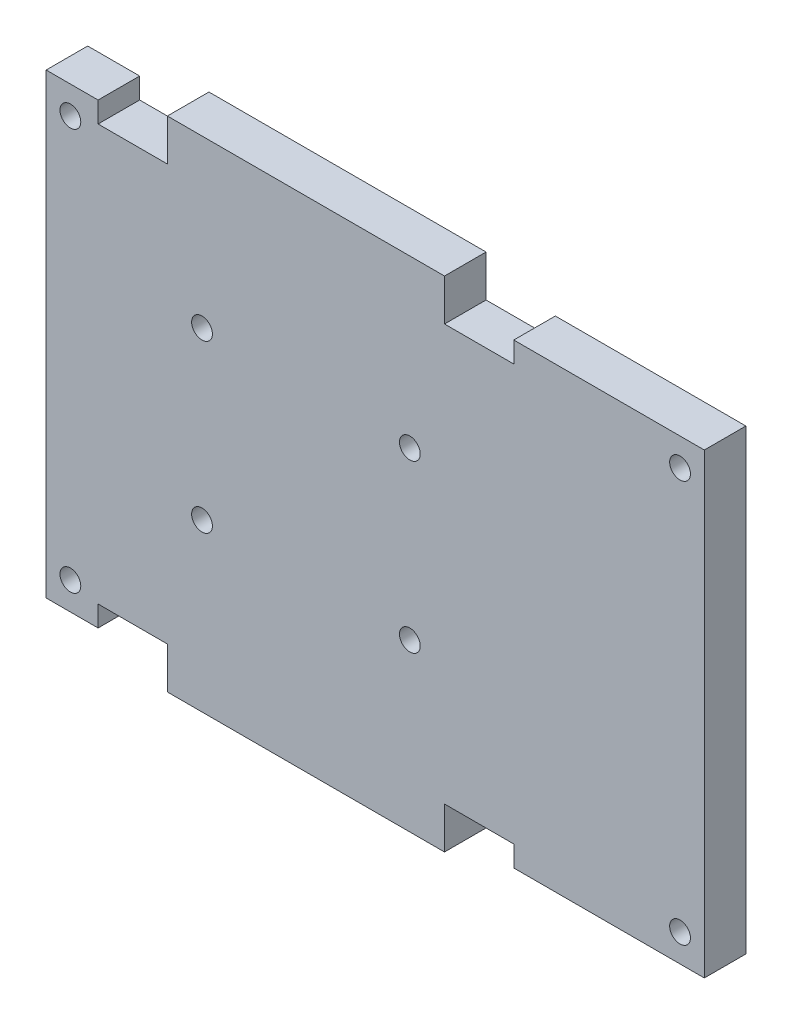
ISO-10303-21;
HEADER;
FILE_DESCRIPTION(('STEP AP214'),'2;1');
FILE_NAME('part.step','',(''),(''),'','','');
FILE_SCHEMA(('AUTOMOTIVE_DESIGN { 1 0 10303 214 1 1 1 1 }'));
ENDSEC;
DATA;
#1=APPLICATION_CONTEXT('core data for automotive mechanical design processes');
#2=APPLICATION_PROTOCOL_DEFINITION('international standard','automotive_design',2000,#1);
#3=PRODUCT_CONTEXT('',#1,'mechanical');
#4=PRODUCT('Part','Part','',(#3));
#5=PRODUCT_RELATED_PRODUCT_CATEGORY('part','',(#4));
#6=PRODUCT_DEFINITION_FORMATION('','',#4);
#7=PRODUCT_DEFINITION_CONTEXT('part definition',#1,'design');
#8=PRODUCT_DEFINITION('design','',#6,#7);
#9=PRODUCT_DEFINITION_SHAPE('','',#8);
#10=(LENGTH_UNIT() NAMED_UNIT(*) SI_UNIT(.MILLI.,.METRE.));
#11=(NAMED_UNIT(*) PLANE_ANGLE_UNIT() SI_UNIT($,.RADIAN.));
#12=(NAMED_UNIT(*) SI_UNIT($,.STERADIAN.) SOLID_ANGLE_UNIT());
#13=UNCERTAINTY_MEASURE_WITH_UNIT(LENGTH_MEASURE(1.E-05),#10,'distance_accuracy_value','');
#14=(GEOMETRIC_REPRESENTATION_CONTEXT(3) GLOBAL_UNCERTAINTY_ASSIGNED_CONTEXT((#13)) GLOBAL_UNIT_ASSIGNED_CONTEXT((#10,
#11,#12)) REPRESENTATION_CONTEXT('',''));
#15=CARTESIAN_POINT('',(0.,0.,0.));
#16=DIRECTION('',(0.,0.,1.));
#17=DIRECTION('',(1.,0.,0.));
#18=AXIS2_PLACEMENT_3D('',#15,#16,#17);
#19=CARTESIAN_POINT('',(-30.,36.,6.));
#20=DIRECTION('',(0.,-1.,0.));
#21=DIRECTION('',(0.,0.,-1.));
#22=AXIS2_PLACEMENT_3D('',#19,#20,#21);
#23=PLANE('',#22);
#24=DIRECTION('',(-1.,0.,0.));
#25=VECTOR('',#24,1.);
#26=CARTESIAN_POINT('',(-30.,36.,6.));
#27=LINE('',#26,#25);
#28=CARTESIAN_POINT('',(20.,36.,6.));
#29=VERTEX_POINT('',#28);
#30=CARTESIAN_POINT('',(-20.,36.,6.));
#31=VERTEX_POINT('',#30);
#32=EDGE_CURVE('E43',#29,#31,#27,.T.);
#33=ORIENTED_EDGE('',*,*,#32,.F.);
#34=DIRECTION('',(0.,0.,1.));
#35=VECTOR('',#34,1.);
#36=CARTESIAN_POINT('',(20.,36.,0.));
#37=LINE('',#36,#35);
#38=CARTESIAN_POINT('',(20.,36.,0.));
#39=VERTEX_POINT('',#38);
#40=EDGE_CURVE('E293',#39,#29,#37,.T.);
#41=ORIENTED_EDGE('',*,*,#40,.F.);
#42=DIRECTION('',(-1.,0.,0.));
#43=VECTOR('',#42,1.);
#44=CARTESIAN_POINT('',(-30.,36.,0.));
#45=LINE('',#44,#43);
#46=CARTESIAN_POINT('',(-20.,36.,0.));
#47=VERTEX_POINT('',#46);
#48=EDGE_CURVE('E336',#39,#47,#45,.T.);
#49=ORIENTED_EDGE('',*,*,#48,.T.);
#50=DIRECTION('',(0.,0.,1.));
#51=VECTOR('',#50,1.);
#52=CARTESIAN_POINT('',(-20.,36.,0.));
#53=LINE('',#52,#51);
#54=EDGE_CURVE('E304',#47,#31,#53,.T.);
#55=ORIENTED_EDGE('',*,*,#54,.T.);
#56=EDGE_LOOP('',(#33,#41,#49,#55));
#57=FACE_BOUND('',#56,.T.);
#58=ADVANCED_FACE('F35',(#57),#23,.F.);
#59=CARTESIAN_POINT('',(-30.,-36.,6.));
#60=DIRECTION('',(0.,1.,0.));
#61=DIRECTION('',(0.,0.,1.));
#62=AXIS2_PLACEMENT_3D('',#59,#60,#61);
#63=PLANE('',#62);
#64=DIRECTION('',(1.,0.,0.));
#65=VECTOR('',#64,1.);
#66=CARTESIAN_POINT('',(-30.,-36.,0.));
#67=LINE('',#66,#65);
#68=CARTESIAN_POINT('',(-20.,-36.,0.));
#69=VERTEX_POINT('',#68);
#70=CARTESIAN_POINT('',(20.,-36.,0.));
#71=VERTEX_POINT('',#70);
#72=EDGE_CURVE('E38',#69,#71,#67,.T.);
#73=ORIENTED_EDGE('',*,*,#72,.T.);
#74=DIRECTION('',(0.,0.,1.));
#75=VECTOR('',#74,1.);
#76=CARTESIAN_POINT('',(20.,-36.,0.));
#77=LINE('',#76,#75);
#78=CARTESIAN_POINT('',(20.,-36.,6.));
#79=VERTEX_POINT('',#78);
#80=EDGE_CURVE('E268',#71,#79,#77,.T.);
#81=ORIENTED_EDGE('',*,*,#80,.T.);
#82=DIRECTION('',(1.,0.,0.));
#83=VECTOR('',#82,1.);
#84=CARTESIAN_POINT('',(-30.,-36.,6.));
#85=LINE('',#84,#83);
#86=CARTESIAN_POINT('',(-20.,-36.,6.));
#87=VERTEX_POINT('',#86);
#88=EDGE_CURVE('E11',#87,#79,#85,.T.);
#89=ORIENTED_EDGE('',*,*,#88,.F.);
#90=DIRECTION('',(0.,0.,1.));
#91=VECTOR('',#90,1.);
#92=CARTESIAN_POINT('',(-20.,-36.,0.));
#93=LINE('',#92,#91);
#94=EDGE_CURVE('E270',#69,#87,#93,.T.);
#95=ORIENTED_EDGE('',*,*,#94,.F.);
#96=EDGE_LOOP('',(#73,#81,#89,#95));
#97=FACE_BOUND('',#96,.T.);
#98=ADVANCED_FACE('F346',(#97),#63,.F.);
#99=CARTESIAN_POINT('',(0.,0.,6.));
#100=DIRECTION('',(0.,0.,-1.));
#101=DIRECTION('',(-1.,0.,0.));
#102=AXIS2_PLACEMENT_3D('',#99,#100,#101);
#103=PLANE('',#102);
#104=CARTESIAN_POINT('',(-34.,-29.,6.));
#105=DIRECTION('',(0.,0.,1.));
#106=DIRECTION('',(1.,0.,0.));
#107=AXIS2_PLACEMENT_3D('',#104,#105,#106);
#108=CIRCLE('',#107,1.5);
#109=CARTESIAN_POINT('',(-32.5,-29.,6.));
#110=VERTEX_POINT('',#109);
#111=EDGE_CURVE('E396',#110,#110,#108,.T.);
#112=ORIENTED_EDGE('',*,*,#111,.F.);
#113=EDGE_LOOP('',(#112));
#114=FACE_BOUND('',#113,.T.);
#115=CARTESIAN_POINT('',(-34.,29.,6.));
#116=DIRECTION('',(0.,0.,1.));
#117=DIRECTION('',(1.,0.,0.));
#118=AXIS2_PLACEMENT_3D('',#115,#116,#117);
#119=CIRCLE('',#118,1.5);
#120=CARTESIAN_POINT('',(-32.5,29.,6.));
#121=VERTEX_POINT('',#120);
#122=EDGE_CURVE('E402',#121,#121,#119,.T.);
#123=ORIENTED_EDGE('',*,*,#122,.F.);
#124=EDGE_LOOP('',(#123));
#125=FACE_BOUND('',#124,.T.);
#126=CARTESIAN_POINT('',(54.,29.,6.));
#127=DIRECTION('',(0.,0.,1.));
#128=DIRECTION('',(1.,0.,0.));
#129=AXIS2_PLACEMENT_3D('',#126,#127,#128);
#130=CIRCLE('',#129,1.5);
#131=CARTESIAN_POINT('',(55.5,29.,6.));
#132=VERTEX_POINT('',#131);
#133=EDGE_CURVE('E408',#132,#132,#130,.T.);
#134=ORIENTED_EDGE('',*,*,#133,.F.);
#135=EDGE_LOOP('',(#134));
#136=FACE_BOUND('',#135,.T.);
#137=CARTESIAN_POINT('',(54.,-29.,6.));
#138=DIRECTION('',(0.,0.,1.));
#139=DIRECTION('',(1.,0.,0.));
#140=AXIS2_PLACEMENT_3D('',#137,#138,#139);
#141=CIRCLE('',#140,1.5);
#142=CARTESIAN_POINT('',(55.5,-29.,6.));
#143=VERTEX_POINT('',#142);
#144=EDGE_CURVE('E390',#143,#143,#141,.T.);
#145=ORIENTED_EDGE('',*,*,#144,.F.);
#146=EDGE_LOOP('',(#145));
#147=FACE_BOUND('',#146,.T.);
#148=CARTESIAN_POINT('',(15.,12.,6.));
#149=DIRECTION('',(0.,0.,1.));
#150=DIRECTION('',(1.,0.,0.));
#151=AXIS2_PLACEMENT_3D('',#148,#149,#150);
#152=CIRCLE('',#151,1.5);
#153=CARTESIAN_POINT('',(16.5,12.,6.));
#154=VERTEX_POINT('',#153);
#155=EDGE_CURVE('E239',#154,#154,#152,.T.);
#156=ORIENTED_EDGE('',*,*,#155,.F.);
#157=EDGE_LOOP('',(#156));
#158=FACE_BOUND('',#157,.T.);
#159=CARTESIAN_POINT('',(15.,-12.,6.));
#160=DIRECTION('',(0.,0.,1.));
#161=DIRECTION('',(1.,0.,0.));
#162=AXIS2_PLACEMENT_3D('',#159,#160,#161);
#163=CIRCLE('',#162,1.5);
#164=CARTESIAN_POINT('',(16.5,-12.,6.));
#165=VERTEX_POINT('',#164);
#166=EDGE_CURVE('E250',#165,#165,#163,.T.);
#167=ORIENTED_EDGE('',*,*,#166,.F.);
#168=EDGE_LOOP('',(#167));
#169=FACE_BOUND('',#168,.T.);
#170=CARTESIAN_POINT('',(-15.,-12.,6.));
#171=DIRECTION('',(0.,0.,1.));
#172=DIRECTION('',(1.,0.,0.));
#173=AXIS2_PLACEMENT_3D('',#170,#171,#172);
#174=CIRCLE('',#173,1.5);
#175=CARTESIAN_POINT('',(-13.5,-12.,6.));
#176=VERTEX_POINT('',#175);
#177=EDGE_CURVE('E244',#176,#176,#174,.T.);
#178=ORIENTED_EDGE('',*,*,#177,.F.);
#179=EDGE_LOOP('',(#178));
#180=FACE_BOUND('',#179,.T.);
#181=CARTESIAN_POINT('',(-15.,12.,6.));
#182=DIRECTION('',(0.,0.,1.));
#183=DIRECTION('',(1.,0.,0.));
#184=AXIS2_PLACEMENT_3D('',#181,#182,#183);
#185=CIRCLE('',#184,1.5);
#186=CARTESIAN_POINT('',(-13.5,12.,6.));
#187=VERTEX_POINT('',#186);
#188=EDGE_CURVE('E243',#187,#187,#185,.T.);
#189=ORIENTED_EDGE('',*,*,#188,.F.);
#190=EDGE_LOOP('',(#189));
#191=FACE_BOUND('',#190,.T.);
#192=DIRECTION('',(1.,0.,0.));
#193=VECTOR('',#192,1.);
#194=CARTESIAN_POINT('',(0.,-30.,6.));
#195=LINE('',#194,#193);
#196=CARTESIAN_POINT('',(20.,-30.,6.));
#197=VERTEX_POINT('',#196);
#198=CARTESIAN_POINT('',(30.,-30.,6.));
#199=VERTEX_POINT('',#198);
#200=EDGE_CURVE('E324',#197,#199,#195,.T.);
#201=ORIENTED_EDGE('',*,*,#200,.T.);
#202=DIRECTION('',(0.,-1.,0.));
#203=VECTOR('',#202,1.);
#204=CARTESIAN_POINT('',(30.,33.,6.));
#205=LINE('',#204,#203);
#206=CARTESIAN_POINT('',(30.,-33.,5.99999999999999));
#207=VERTEX_POINT('',#206);
#208=EDGE_CURVE('E201',#199,#207,#205,.T.);
#209=ORIENTED_EDGE('',*,*,#208,.T.);
#210=DIRECTION('',(-1.,0.,0.));
#211=VECTOR('',#210,1.);
#212=CARTESIAN_POINT('',(57.5,-33.,5.99999999999999));
#213=LINE('',#212,#211);
#214=CARTESIAN_POINT('',(57.5,-33.,5.99999999999999));
#215=VERTEX_POINT('',#214);
#216=EDGE_CURVE('E236',#215,#207,#213,.T.);
#217=ORIENTED_EDGE('',*,*,#216,.F.);
#218=DIRECTION('',(0.,-1.,0.));
#219=VECTOR('',#218,1.);
#220=CARTESIAN_POINT('',(57.5,33.,6.));
#221=LINE('',#220,#219);
#222=CARTESIAN_POINT('',(57.5,33.,6.));
#223=VERTEX_POINT('',#222);
#224=EDGE_CURVE('E209',#223,#215,#221,.T.);
#225=ORIENTED_EDGE('',*,*,#224,.F.);
#226=DIRECTION('',(-1.,0.,0.));
#227=VECTOR('',#226,1.);
#228=CARTESIAN_POINT('',(57.5,33.,6.));
#229=LINE('',#228,#227);
#230=CARTESIAN_POINT('',(30.,33.,6.));
#231=VERTEX_POINT('',#230);
#232=EDGE_CURVE('E218',#223,#231,#229,.T.);
#233=ORIENTED_EDGE('',*,*,#232,.T.);
#234=CARTESIAN_POINT('',(30.,30.,6.));
#235=VERTEX_POINT('',#234);
#236=EDGE_CURVE('E203',#231,#235,#205,.T.);
#237=ORIENTED_EDGE('',*,*,#236,.T.);
#238=DIRECTION('',(-1.,0.,0.));
#239=VECTOR('',#238,1.);
#240=CARTESIAN_POINT('',(0.,30.,6.));
#241=LINE('',#240,#239);
#242=CARTESIAN_POINT('',(20.,30.,6.));
#243=VERTEX_POINT('',#242);
#244=EDGE_CURVE('E333',#235,#243,#241,.T.);
#245=ORIENTED_EDGE('',*,*,#244,.T.);
#246=DIRECTION('',(0.,1.,0.));
#247=VECTOR('',#246,1.);
#248=CARTESIAN_POINT('',(20.,0.,6.));
#249=LINE('',#248,#247);
#250=EDGE_CURVE('E330',#243,#29,#249,.T.);
#251=ORIENTED_EDGE('',*,*,#250,.T.);
#252=ORIENTED_EDGE('',*,*,#32,.T.);
#253=DIRECTION('',(0.,-1.,0.));
#254=VECTOR('',#253,1.);
#255=CARTESIAN_POINT('',(-20.,0.,6.));
#256=LINE('',#255,#254);
#257=CARTESIAN_POINT('',(-20.,30.,6.));
#258=VERTEX_POINT('',#257);
#259=EDGE_CURVE('E315',#31,#258,#256,.T.);
#260=ORIENTED_EDGE('',*,*,#259,.T.);
#261=DIRECTION('',(-1.,0.,0.));
#262=VECTOR('',#261,1.);
#263=CARTESIAN_POINT('',(0.,30.,6.));
#264=LINE('',#263,#262);
#265=CARTESIAN_POINT('',(-30.,30.,6.));
#266=VERTEX_POINT('',#265);
#267=EDGE_CURVE('E307',#258,#266,#264,.T.);
#268=ORIENTED_EDGE('',*,*,#267,.T.);
#269=DIRECTION('',(0.,1.,0.));
#270=VECTOR('',#269,1.);
#271=CARTESIAN_POINT('',(-30.,33.,6.));
#272=LINE('',#271,#270);
#273=CARTESIAN_POINT('',(-30.,33.,6.));
#274=VERTEX_POINT('',#273);
#275=EDGE_CURVE('E367',#266,#274,#272,.T.);
#276=ORIENTED_EDGE('',*,*,#275,.T.);
#277=DIRECTION('',(1.,0.,0.));
#278=VECTOR('',#277,1.);
#279=CARTESIAN_POINT('',(-37.5,33.,6.));
#280=LINE('',#279,#278);
#281=CARTESIAN_POINT('',(-37.5,33.,6.));
#282=VERTEX_POINT('',#281);
#283=EDGE_CURVE('E205',#282,#274,#280,.T.);
#284=ORIENTED_EDGE('',*,*,#283,.F.);
#285=DIRECTION('',(0.,1.,0.));
#286=VECTOR('',#285,1.);
#287=CARTESIAN_POINT('',(-37.5,33.,6.));
#288=LINE('',#287,#286);
#289=CARTESIAN_POINT('',(-37.5,-33.,6.));
#290=VERTEX_POINT('',#289);
#291=EDGE_CURVE('E185',#290,#282,#288,.T.);
#292=ORIENTED_EDGE('',*,*,#291,.F.);
#293=DIRECTION('',(1.,0.,0.));
#294=VECTOR('',#293,1.);
#295=CARTESIAN_POINT('',(-37.5,-33.,6.));
#296=LINE('',#295,#294);
#297=CARTESIAN_POINT('',(-30.,-33.,6.));
#298=VERTEX_POINT('',#297);
#299=EDGE_CURVE('E182',#290,#298,#296,.T.);
#300=ORIENTED_EDGE('',*,*,#299,.T.);
#301=CARTESIAN_POINT('',(-30.,-30.,6.));
#302=VERTEX_POINT('',#301);
#303=EDGE_CURVE('E366',#298,#302,#272,.T.);
#304=ORIENTED_EDGE('',*,*,#303,.T.);
#305=DIRECTION('',(1.,0.,0.));
#306=VECTOR('',#305,1.);
#307=CARTESIAN_POINT('',(0.,-30.,6.));
#308=LINE('',#307,#306);
#309=CARTESIAN_POINT('',(-20.,-30.,6.));
#310=VERTEX_POINT('',#309);
#311=EDGE_CURVE('E321',#302,#310,#308,.T.);
#312=ORIENTED_EDGE('',*,*,#311,.T.);
#313=DIRECTION('',(0.,-1.,0.));
#314=VECTOR('',#313,1.);
#315=CARTESIAN_POINT('',(-20.,0.,6.));
#316=LINE('',#315,#314);
#317=EDGE_CURVE('E318',#310,#87,#316,.T.);
#318=ORIENTED_EDGE('',*,*,#317,.T.);
#319=ORIENTED_EDGE('',*,*,#88,.T.);
#320=DIRECTION('',(0.,1.,0.));
#321=VECTOR('',#320,1.);
#322=CARTESIAN_POINT('',(20.,0.,6.));
#323=LINE('',#322,#321);
#324=EDGE_CURVE('E327',#79,#197,#323,.T.);
#325=ORIENTED_EDGE('',*,*,#324,.T.);
#326=EDGE_LOOP('',(#201,#209,#217,#225,#233,#237,#245,#251,#252,#260,#268,#276,#284,#292,#300,
#304,#312,#318,#319,#325));
#327=FACE_BOUND('',#326,.T.);
#328=ADVANCED_FACE('F354',(#114,#125,#136,#147,#158,#169,#180,#191,#327),#103,.F.);
#329=CARTESIAN_POINT('',(0.,0.,0.));
#330=DIRECTION('',(0.,0.,-1.));
#331=DIRECTION('',(-1.,0.,0.));
#332=AXIS2_PLACEMENT_3D('',#329,#330,#331);
#333=PLANE('',#332);
#334=CARTESIAN_POINT('',(-34.,-29.,0.));
#335=DIRECTION('',(0.,0.,1.));
#336=DIRECTION('',(1.,0.,0.));
#337=AXIS2_PLACEMENT_3D('',#334,#335,#336);
#338=CIRCLE('',#337,1.5);
#339=CARTESIAN_POINT('',(-32.5,-29.,0.));
#340=VERTEX_POINT('',#339);
#341=EDGE_CURVE('E399',#340,#340,#338,.T.);
#342=ORIENTED_EDGE('',*,*,#341,.T.);
#343=EDGE_LOOP('',(#342));
#344=FACE_BOUND('',#343,.T.);
#345=CARTESIAN_POINT('',(-34.,29.,0.));
#346=DIRECTION('',(0.,0.,1.));
#347=DIRECTION('',(1.,0.,0.));
#348=AXIS2_PLACEMENT_3D('',#345,#346,#347);
#349=CIRCLE('',#348,1.5);
#350=CARTESIAN_POINT('',(-32.5,29.,0.));
#351=VERTEX_POINT('',#350);
#352=EDGE_CURVE('E405',#351,#351,#349,.T.);
#353=ORIENTED_EDGE('',*,*,#352,.T.);
#354=EDGE_LOOP('',(#353));
#355=FACE_BOUND('',#354,.T.);
#356=CARTESIAN_POINT('',(54.,29.,0.));
#357=DIRECTION('',(0.,0.,1.));
#358=DIRECTION('',(1.,0.,0.));
#359=AXIS2_PLACEMENT_3D('',#356,#357,#358);
#360=CIRCLE('',#359,1.5);
#361=CARTESIAN_POINT('',(55.5,29.,0.));
#362=VERTEX_POINT('',#361);
#363=EDGE_CURVE('E393',#362,#362,#360,.T.);
#364=ORIENTED_EDGE('',*,*,#363,.T.);
#365=EDGE_LOOP('',(#364));
#366=FACE_BOUND('',#365,.T.);
#367=CARTESIAN_POINT('',(54.,-29.,0.));
#368=DIRECTION('',(0.,0.,1.));
#369=DIRECTION('',(1.,0.,0.));
#370=AXIS2_PLACEMENT_3D('',#367,#368,#369);
#371=CIRCLE('',#370,1.5);
#372=CARTESIAN_POINT('',(55.5,-29.,0.));
#373=VERTEX_POINT('',#372);
#374=EDGE_CURVE('E386',#373,#373,#371,.T.);
#375=ORIENTED_EDGE('',*,*,#374,.T.);
#376=EDGE_LOOP('',(#375));
#377=FACE_BOUND('',#376,.T.);
#378=CARTESIAN_POINT('',(15.,12.,0.));
#379=DIRECTION('',(0.,0.,1.));
#380=DIRECTION('',(1.,0.,0.));
#381=AXIS2_PLACEMENT_3D('',#378,#379,#380);
#382=CIRCLE('',#381,1.5);
#383=CARTESIAN_POINT('',(16.5,12.,0.));
#384=VERTEX_POINT('',#383);
#385=EDGE_CURVE('E253',#384,#384,#382,.T.);
#386=ORIENTED_EDGE('',*,*,#385,.T.);
#387=EDGE_LOOP('',(#386));
#388=FACE_BOUND('',#387,.T.);
#389=CARTESIAN_POINT('',(15.,-12.,0.));
#390=DIRECTION('',(0.,0.,1.));
#391=DIRECTION('',(1.,0.,0.));
#392=AXIS2_PLACEMENT_3D('',#389,#390,#391);
#393=CIRCLE('',#392,1.5);
#394=CARTESIAN_POINT('',(16.5,-12.,0.));
#395=VERTEX_POINT('',#394);
#396=EDGE_CURVE('E247',#395,#395,#393,.T.);
#397=ORIENTED_EDGE('',*,*,#396,.T.);
#398=EDGE_LOOP('',(#397));
#399=FACE_BOUND('',#398,.T.);
#400=CARTESIAN_POINT('',(-15.,-12.,0.));
#401=DIRECTION('',(0.,0.,1.));
#402=DIRECTION('',(1.,0.,0.));
#403=AXIS2_PLACEMENT_3D('',#400,#401,#402);
#404=CIRCLE('',#403,1.5);
#405=CARTESIAN_POINT('',(-13.5,-12.,0.));
#406=VERTEX_POINT('',#405);
#407=EDGE_CURVE('E240',#406,#406,#404,.T.);
#408=ORIENTED_EDGE('',*,*,#407,.T.);
#409=EDGE_LOOP('',(#408));
#410=FACE_BOUND('',#409,.T.);
#411=CARTESIAN_POINT('',(-15.,12.,0.));
#412=DIRECTION('',(0.,0.,1.));
#413=DIRECTION('',(1.,0.,0.));
#414=AXIS2_PLACEMENT_3D('',#411,#412,#413);
#415=CIRCLE('',#414,1.5);
#416=CARTESIAN_POINT('',(-13.5,12.,0.));
#417=VERTEX_POINT('',#416);
#418=EDGE_CURVE('E258',#417,#417,#415,.T.);
#419=ORIENTED_EDGE('',*,*,#418,.T.);
#420=EDGE_LOOP('',(#419));
#421=FACE_BOUND('',#420,.T.);
#422=DIRECTION('',(1.,0.,0.));
#423=VECTOR('',#422,1.);
#424=CARTESIAN_POINT('',(30.,30.,0.));
#425=LINE('',#424,#423);
#426=CARTESIAN_POINT('',(20.,30.,0.));
#427=VERTEX_POINT('',#426);
#428=CARTESIAN_POINT('',(30.,30.,0.));
#429=VERTEX_POINT('',#428);
#430=EDGE_CURVE('E51',#427,#429,#425,.T.);
#431=ORIENTED_EDGE('',*,*,#430,.T.);
#432=DIRECTION('',(0.,1.,0.));
#433=VECTOR('',#432,1.);
#434=CARTESIAN_POINT('',(30.,33.,0.));
#435=LINE('',#434,#433);
#436=CARTESIAN_POINT('',(30.,33.,0.));
#437=VERTEX_POINT('',#436);
#438=EDGE_CURVE('E223',#429,#437,#435,.T.);
#439=ORIENTED_EDGE('',*,*,#438,.T.);
#440=DIRECTION('',(-1.,0.,0.));
#441=VECTOR('',#440,1.);
#442=CARTESIAN_POINT('',(57.5,33.,0.));
#443=LINE('',#442,#441);
#444=CARTESIAN_POINT('',(57.5,33.,0.));
#445=VERTEX_POINT('',#444);
#446=EDGE_CURVE('E230',#445,#437,#443,.T.);
#447=ORIENTED_EDGE('',*,*,#446,.F.);
#448=DIRECTION('',(0.,1.,0.));
#449=VECTOR('',#448,1.);
#450=CARTESIAN_POINT('',(57.5,33.,0.));
#451=LINE('',#450,#449);
#452=CARTESIAN_POINT('',(57.5,-33.,0.));
#453=VERTEX_POINT('',#452);
#454=EDGE_CURVE('E215',#453,#445,#451,.T.);
#455=ORIENTED_EDGE('',*,*,#454,.F.);
#456=DIRECTION('',(-1.,0.,0.));
#457=VECTOR('',#456,1.);
#458=CARTESIAN_POINT('',(57.5,-33.,0.));
#459=LINE('',#458,#457);
#460=CARTESIAN_POINT('',(30.,-33.,0.));
#461=VERTEX_POINT('',#460);
#462=EDGE_CURVE('E233',#453,#461,#459,.T.);
#463=ORIENTED_EDGE('',*,*,#462,.T.);
#464=CARTESIAN_POINT('',(30.,-30.,0.));
#465=VERTEX_POINT('',#464);
#466=EDGE_CURVE('E224',#461,#465,#435,.T.);
#467=ORIENTED_EDGE('',*,*,#466,.T.);
#468=DIRECTION('',(-1.,0.,0.));
#469=VECTOR('',#468,1.);
#470=CARTESIAN_POINT('',(30.,-30.,0.));
#471=LINE('',#470,#469);
#472=CARTESIAN_POINT('',(20.,-30.,0.));
#473=VERTEX_POINT('',#472);
#474=EDGE_CURVE('E278',#465,#473,#471,.T.);
#475=ORIENTED_EDGE('',*,*,#474,.T.);
#476=DIRECTION('',(0.,-1.,0.));
#477=VECTOR('',#476,1.);
#478=CARTESIAN_POINT('',(20.,-36.,0.));
#479=LINE('',#478,#477);
#480=EDGE_CURVE('E59',#473,#71,#479,.T.);
#481=ORIENTED_EDGE('',*,*,#480,.T.);
#482=ORIENTED_EDGE('',*,*,#72,.F.);
#483=DIRECTION('',(0.,1.,0.));
#484=VECTOR('',#483,1.);
#485=CARTESIAN_POINT('',(-20.,-36.,0.));
#486=LINE('',#485,#484);
#487=CARTESIAN_POINT('',(-20.,-30.,0.));
#488=VERTEX_POINT('',#487);
#489=EDGE_CURVE('E264',#69,#488,#486,.T.);
#490=ORIENTED_EDGE('',*,*,#489,.T.);
#491=DIRECTION('',(-1.,0.,0.));
#492=VECTOR('',#491,1.);
#493=CARTESIAN_POINT('',(-30.,-30.,0.));
#494=LINE('',#493,#492);
#495=CARTESIAN_POINT('',(-30.,-30.,0.));
#496=VERTEX_POINT('',#495);
#497=EDGE_CURVE('E267',#488,#496,#494,.T.);
#498=ORIENTED_EDGE('',*,*,#497,.T.);
#499=DIRECTION('',(0.,-1.,0.));
#500=VECTOR('',#499,1.);
#501=CARTESIAN_POINT('',(-30.,33.,0.));
#502=LINE('',#501,#500);
#503=CARTESIAN_POINT('',(-30.,-33.,0.));
#504=VERTEX_POINT('',#503);
#505=EDGE_CURVE('E199',#496,#504,#502,.T.);
#506=ORIENTED_EDGE('',*,*,#505,.T.);
#507=DIRECTION('',(1.,0.,0.));
#508=VECTOR('',#507,1.);
#509=CARTESIAN_POINT('',(-37.5,-33.,0.));
#510=LINE('',#509,#508);
#511=CARTESIAN_POINT('',(-37.5,-33.,0.));
#512=VERTEX_POINT('',#511);
#513=EDGE_CURVE('E180',#512,#504,#510,.T.);
#514=ORIENTED_EDGE('',*,*,#513,.F.);
#515=DIRECTION('',(0.,-1.,0.));
#516=VECTOR('',#515,1.);
#517=CARTESIAN_POINT('',(-37.5,33.,0.));
#518=LINE('',#517,#516);
#519=CARTESIAN_POINT('',(-37.5,33.,0.));
#520=VERTEX_POINT('',#519);
#521=EDGE_CURVE('E186',#520,#512,#518,.T.);
#522=ORIENTED_EDGE('',*,*,#521,.F.);
#523=DIRECTION('',(1.,0.,0.));
#524=VECTOR('',#523,1.);
#525=CARTESIAN_POINT('',(-37.5,33.,0.));
#526=LINE('',#525,#524);
#527=CARTESIAN_POINT('',(-30.,33.,0.));
#528=VERTEX_POINT('',#527);
#529=EDGE_CURVE('E374',#520,#528,#526,.T.);
#530=ORIENTED_EDGE('',*,*,#529,.T.);
#531=CARTESIAN_POINT('',(-30.,30.,0.));
#532=VERTEX_POINT('',#531);
#533=EDGE_CURVE('E384',#528,#532,#502,.T.);
#534=ORIENTED_EDGE('',*,*,#533,.T.);
#535=DIRECTION('',(1.,0.,0.));
#536=VECTOR('',#535,1.);
#537=CARTESIAN_POINT('',(-30.,30.,0.));
#538=LINE('',#537,#536);
#539=CARTESIAN_POINT('',(-20.,30.,0.));
#540=VERTEX_POINT('',#539);
#541=EDGE_CURVE('E273',#532,#540,#538,.T.);
#542=ORIENTED_EDGE('',*,*,#541,.T.);
#543=DIRECTION('',(0.,1.,0.));
#544=VECTOR('',#543,1.);
#545=CARTESIAN_POINT('',(-20.,36.,0.));
#546=LINE('',#545,#544);
#547=EDGE_CURVE('E300',#540,#47,#546,.T.);
#548=ORIENTED_EDGE('',*,*,#547,.T.);
#549=ORIENTED_EDGE('',*,*,#48,.F.);
#550=DIRECTION('',(0.,-1.,0.));
#551=VECTOR('',#550,1.);
#552=CARTESIAN_POINT('',(20.,36.,0.));
#553=LINE('',#552,#551);
#554=EDGE_CURVE('E261',#39,#427,#553,.T.);
#555=ORIENTED_EDGE('',*,*,#554,.T.);
#556=EDGE_LOOP('',(#431,#439,#447,#455,#463,#467,#475,#481,#482,#490,#498,#506,#514,#522,#530,
#534,#542,#548,#549,#555));
#557=FACE_BOUND('',#556,.T.);
#558=ADVANCED_FACE('F197',(#344,#355,#366,#377,#388,#399,#410,#421,#557),#333,.T.);
#559=CARTESIAN_POINT('',(-20.,36.,0.));
#560=DIRECTION('',(1.,0.,0.));
#561=DIRECTION('',(0.,0.,-1.));
#562=AXIS2_PLACEMENT_3D('',#559,#560,#561);
#563=PLANE('',#562);
#564=ORIENTED_EDGE('',*,*,#54,.F.);
#565=ORIENTED_EDGE('',*,*,#547,.F.);
#566=DIRECTION('',(0.,0.,1.));
#567=VECTOR('',#566,1.);
#568=CARTESIAN_POINT('',(-20.,30.,0.));
#569=LINE('',#568,#567);
#570=EDGE_CURVE('E308',#540,#258,#569,.T.);
#571=ORIENTED_EDGE('',*,*,#570,.T.);
#572=ORIENTED_EDGE('',*,*,#259,.F.);
#573=EDGE_LOOP('',(#564,#565,#571,#572));
#574=FACE_BOUND('',#573,.T.);
#575=ADVANCED_FACE('F468',(#574),#563,.F.);
#576=CARTESIAN_POINT('',(-30.,30.,0.));
#577=DIRECTION('',(0.,-1.,0.));
#578=DIRECTION('',(0.,0.,-1.));
#579=AXIS2_PLACEMENT_3D('',#576,#577,#578);
#580=PLANE('',#579);
#581=ORIENTED_EDGE('',*,*,#570,.F.);
#582=ORIENTED_EDGE('',*,*,#541,.F.);
#583=DIRECTION('',(0.,0.,1.));
#584=VECTOR('',#583,1.);
#585=CARTESIAN_POINT('',(-30.,30.,0.));
#586=LINE('',#585,#584);
#587=EDGE_CURVE('E303',#532,#266,#586,.T.);
#588=ORIENTED_EDGE('',*,*,#587,.T.);
#589=ORIENTED_EDGE('',*,*,#267,.F.);
#590=EDGE_LOOP('',(#581,#582,#588,#589));
#591=FACE_BOUND('',#590,.T.);
#592=ADVANCED_FACE('F470',(#591),#580,.F.);
#593=CARTESIAN_POINT('',(-30.,-30.,0.));
#594=DIRECTION('',(0.,1.,0.));
#595=DIRECTION('',(0.,0.,1.));
#596=AXIS2_PLACEMENT_3D('',#593,#594,#595);
#597=PLANE('',#596);
#598=DIRECTION('',(0.,0.,1.));
#599=VECTOR('',#598,1.);
#600=CARTESIAN_POINT('',(-30.,-30.,0.));
#601=LINE('',#600,#599);
#602=EDGE_CURVE('E271',#496,#302,#601,.T.);
#603=ORIENTED_EDGE('',*,*,#602,.F.);
#604=ORIENTED_EDGE('',*,*,#497,.F.);
#605=DIRECTION('',(0.,0.,1.));
#606=VECTOR('',#605,1.);
#607=CARTESIAN_POINT('',(-20.,-30.,0.));
#608=LINE('',#607,#606);
#609=EDGE_CURVE('E274',#488,#310,#608,.T.);
#610=ORIENTED_EDGE('',*,*,#609,.T.);
#611=ORIENTED_EDGE('',*,*,#311,.F.);
#612=EDGE_LOOP('',(#603,#604,#610,#611));
#613=FACE_BOUND('',#612,.T.);
#614=ADVANCED_FACE('F362',(#613),#597,.F.);
#615=CARTESIAN_POINT('',(-20.,-36.,0.));
#616=DIRECTION('',(1.,0.,0.));
#617=DIRECTION('',(0.,1.,0.));
#618=AXIS2_PLACEMENT_3D('',#615,#616,#617);
#619=PLANE('',#618);
#620=ORIENTED_EDGE('',*,*,#609,.F.);
#621=ORIENTED_EDGE('',*,*,#489,.F.);
#622=ORIENTED_EDGE('',*,*,#94,.T.);
#623=ORIENTED_EDGE('',*,*,#317,.F.);
#624=EDGE_LOOP('',(#620,#621,#622,#623));
#625=FACE_BOUND('',#624,.T.);
#626=ADVANCED_FACE('F359',(#625),#619,.F.);
#627=CARTESIAN_POINT('',(20.,-36.,0.));
#628=DIRECTION('',(-1.,0.,0.));
#629=DIRECTION('',(0.,-1.,0.));
#630=AXIS2_PLACEMENT_3D('',#627,#628,#629);
#631=PLANE('',#630);
#632=ORIENTED_EDGE('',*,*,#80,.F.);
#633=ORIENTED_EDGE('',*,*,#480,.F.);
#634=DIRECTION('',(0.,0.,1.));
#635=VECTOR('',#634,1.);
#636=CARTESIAN_POINT('',(20.,-30.,0.));
#637=LINE('',#636,#635);
#638=EDGE_CURVE('E286',#473,#197,#637,.T.);
#639=ORIENTED_EDGE('',*,*,#638,.T.);
#640=ORIENTED_EDGE('',*,*,#324,.F.);
#641=EDGE_LOOP('',(#632,#633,#639,#640));
#642=FACE_BOUND('',#641,.T.);
#643=ADVANCED_FACE('F352',(#642),#631,.F.);
#644=CARTESIAN_POINT('',(30.,-30.,0.));
#645=DIRECTION('',(0.,1.,0.));
#646=DIRECTION('',(0.,0.,1.));
#647=AXIS2_PLACEMENT_3D('',#644,#645,#646);
#648=PLANE('',#647);
#649=ORIENTED_EDGE('',*,*,#638,.F.);
#650=ORIENTED_EDGE('',*,*,#474,.F.);
#651=DIRECTION('',(0.,0.,1.));
#652=VECTOR('',#651,1.);
#653=CARTESIAN_POINT('',(30.,-30.,0.));
#654=LINE('',#653,#652);
#655=EDGE_CURVE('E283',#465,#199,#654,.T.);
#656=ORIENTED_EDGE('',*,*,#655,.T.);
#657=ORIENTED_EDGE('',*,*,#200,.F.);
#658=EDGE_LOOP('',(#649,#650,#656,#657));
#659=FACE_BOUND('',#658,.T.);
#660=ADVANCED_FACE('F351',(#659),#648,.F.);
#661=CARTESIAN_POINT('',(30.,30.,0.));
#662=DIRECTION('',(0.,-1.,0.));
#663=DIRECTION('',(0.,0.,-1.));
#664=AXIS2_PLACEMENT_3D('',#661,#662,#663);
#665=PLANE('',#664);
#666=DIRECTION('',(0.,0.,1.));
#667=VECTOR('',#666,1.);
#668=CARTESIAN_POINT('',(30.,30.,0.));
#669=LINE('',#668,#667);
#670=EDGE_CURVE('E281',#429,#235,#669,.T.);
#671=ORIENTED_EDGE('',*,*,#670,.F.);
#672=ORIENTED_EDGE('',*,*,#430,.F.);
#673=DIRECTION('',(0.,0.,1.));
#674=VECTOR('',#673,1.);
#675=CARTESIAN_POINT('',(20.,30.,0.));
#676=LINE('',#675,#674);
#677=EDGE_CURVE('E295',#427,#243,#676,.T.);
#678=ORIENTED_EDGE('',*,*,#677,.T.);
#679=ORIENTED_EDGE('',*,*,#244,.F.);
#680=EDGE_LOOP('',(#671,#672,#678,#679));
#681=FACE_BOUND('',#680,.T.);
#682=ADVANCED_FACE('F451',(#681),#665,.F.);
#683=CARTESIAN_POINT('',(20.,36.,0.));
#684=DIRECTION('',(-1.,0.,0.));
#685=DIRECTION('',(0.,-1.,0.));
#686=AXIS2_PLACEMENT_3D('',#683,#684,#685);
#687=PLANE('',#686);
#688=ORIENTED_EDGE('',*,*,#677,.F.);
#689=ORIENTED_EDGE('',*,*,#554,.F.);
#690=ORIENTED_EDGE('',*,*,#40,.T.);
#691=ORIENTED_EDGE('',*,*,#250,.F.);
#692=EDGE_LOOP('',(#688,#689,#690,#691));
#693=FACE_BOUND('',#692,.T.);
#694=ADVANCED_FACE('F441',(#693),#687,.F.);
#695=CARTESIAN_POINT('',(-15.,12.,0.));
#696=DIRECTION('',(0.,0.,1.));
#697=DIRECTION('',(1.,0.,0.));
#698=AXIS2_PLACEMENT_3D('',#695,#696,#697);
#699=CYLINDRICAL_SURFACE('',#698,1.5);
#700=ORIENTED_EDGE('',*,*,#418,.F.);
#701=EDGE_LOOP('',(#700));
#702=FACE_BOUND('',#701,.T.);
#703=ORIENTED_EDGE('',*,*,#188,.T.);
#704=EDGE_LOOP('',(#703));
#705=FACE_BOUND('',#704,.T.);
#706=ADVANCED_FACE('F438',(#702,#705),#699,.F.);
#707=CARTESIAN_POINT('',(-15.,-12.,0.));
#708=DIRECTION('',(0.,0.,1.));
#709=DIRECTION('',(1.,0.,0.));
#710=AXIS2_PLACEMENT_3D('',#707,#708,#709);
#711=CYLINDRICAL_SURFACE('',#710,1.5);
#712=ORIENTED_EDGE('',*,*,#407,.F.);
#713=EDGE_LOOP('',(#712));
#714=FACE_BOUND('',#713,.T.);
#715=ORIENTED_EDGE('',*,*,#177,.T.);
#716=EDGE_LOOP('',(#715));
#717=FACE_BOUND('',#716,.T.);
#718=ADVANCED_FACE('F440',(#714,#717),#711,.F.);
#719=CARTESIAN_POINT('',(15.,-12.,0.));
#720=DIRECTION('',(0.,0.,1.));
#721=DIRECTION('',(1.,0.,0.));
#722=AXIS2_PLACEMENT_3D('',#719,#720,#721);
#723=CYLINDRICAL_SURFACE('',#722,1.5);
#724=ORIENTED_EDGE('',*,*,#396,.F.);
#725=EDGE_LOOP('',(#724));
#726=FACE_BOUND('',#725,.T.);
#727=ORIENTED_EDGE('',*,*,#166,.T.);
#728=EDGE_LOOP('',(#727));
#729=FACE_BOUND('',#728,.T.);
#730=ADVANCED_FACE('F448',(#726,#729),#723,.F.);
#731=CARTESIAN_POINT('',(15.,12.,0.));
#732=DIRECTION('',(0.,0.,1.));
#733=DIRECTION('',(1.,0.,0.));
#734=AXIS2_PLACEMENT_3D('',#731,#732,#733);
#735=CYLINDRICAL_SURFACE('',#734,1.5);
#736=ORIENTED_EDGE('',*,*,#385,.F.);
#737=EDGE_LOOP('',(#736));
#738=FACE_BOUND('',#737,.T.);
#739=ORIENTED_EDGE('',*,*,#155,.T.);
#740=EDGE_LOOP('',(#739));
#741=FACE_BOUND('',#740,.T.);
#742=ADVANCED_FACE('F528',(#738,#741),#735,.F.);
#743=CARTESIAN_POINT('',(30.,0.,0.));
#744=DIRECTION('',(1.,0.,0.));
#745=DIRECTION('',(0.,0.,-1.));
#746=AXIS2_PLACEMENT_3D('',#743,#744,#745);
#747=PLANE('',#746);
#748=ORIENTED_EDGE('',*,*,#438,.F.);
#749=ORIENTED_EDGE('',*,*,#670,.T.);
#750=ORIENTED_EDGE('',*,*,#236,.F.);
#751=DIRECTION('',(0.,0.,1.));
#752=VECTOR('',#751,1.);
#753=CARTESIAN_POINT('',(30.,33.,6.));
#754=LINE('',#753,#752);
#755=EDGE_CURVE('E213',#437,#231,#754,.T.);
#756=ORIENTED_EDGE('',*,*,#755,.F.);
#757=EDGE_LOOP('',(#748,#749,#750,#756));
#758=FACE_BOUND('',#757,.T.);
#759=ADVANCED_FACE('F519',(#758),#747,.F.);
#760=CARTESIAN_POINT('',(57.5,-33.,5.99999999999999));
#761=DIRECTION('',(0.,1.,0.));
#762=DIRECTION('',(0.,0.,1.));
#763=AXIS2_PLACEMENT_3D('',#760,#761,#762);
#764=PLANE('',#763);
#765=DIRECTION('',(0.,0.,-1.));
#766=VECTOR('',#765,1.);
#767=CARTESIAN_POINT('',(30.,-33.,5.99999999999999));
#768=LINE('',#767,#766);
#769=EDGE_CURVE('E221',#207,#461,#768,.T.);
#770=ORIENTED_EDGE('',*,*,#769,.T.);
#771=ORIENTED_EDGE('',*,*,#462,.F.);
#772=DIRECTION('',(0.,0.,-1.));
#773=VECTOR('',#772,1.);
#774=CARTESIAN_POINT('',(57.5,-33.,5.99999999999999));
#775=LINE('',#774,#773);
#776=EDGE_CURVE('E212',#215,#453,#775,.T.);
#777=ORIENTED_EDGE('',*,*,#776,.F.);
#778=ORIENTED_EDGE('',*,*,#216,.T.);
#779=EDGE_LOOP('',(#770,#771,#777,#778));
#780=FACE_BOUND('',#779,.T.);
#781=ADVANCED_FACE('F522',(#780),#764,.F.);
#782=CARTESIAN_POINT('',(57.5,33.,6.));
#783=DIRECTION('',(0.,-1.,0.));
#784=DIRECTION('',(0.,0.,-1.));
#785=AXIS2_PLACEMENT_3D('',#782,#783,#784);
#786=PLANE('',#785);
#787=ORIENTED_EDGE('',*,*,#755,.T.);
#788=ORIENTED_EDGE('',*,*,#232,.F.);
#789=DIRECTION('',(0.,0.,1.));
#790=VECTOR('',#789,1.);
#791=CARTESIAN_POINT('',(57.5,33.,6.));
#792=LINE('',#791,#790);
#793=EDGE_CURVE('E217',#445,#223,#792,.T.);
#794=ORIENTED_EDGE('',*,*,#793,.F.);
#795=ORIENTED_EDGE('',*,*,#446,.T.);
#796=EDGE_LOOP('',(#787,#788,#794,#795));
#797=FACE_BOUND('',#796,.T.);
#798=ADVANCED_FACE('F514',(#797),#786,.F.);
#799=CARTESIAN_POINT('',(57.5,0.,0.));
#800=DIRECTION('',(1.,0.,0.));
#801=DIRECTION('',(0.,0.,-1.));
#802=AXIS2_PLACEMENT_3D('',#799,#800,#801);
#803=PLANE('',#802);
#804=ORIENTED_EDGE('',*,*,#224,.T.);
#805=ORIENTED_EDGE('',*,*,#776,.T.);
#806=ORIENTED_EDGE('',*,*,#454,.T.);
#807=ORIENTED_EDGE('',*,*,#793,.T.);
#808=EDGE_LOOP('',(#804,#805,#806,#807));
#809=FACE_BOUND('',#808,.T.);
#810=ADVANCED_FACE('F510',(#809),#803,.T.);
#811=ORIENTED_EDGE('',*,*,#655,.F.);
#812=ORIENTED_EDGE('',*,*,#466,.F.);
#813=ORIENTED_EDGE('',*,*,#769,.F.);
#814=ORIENTED_EDGE('',*,*,#208,.F.);
#815=EDGE_LOOP('',(#811,#812,#813,#814));
#816=FACE_BOUND('',#815,.T.);
#817=ADVANCED_FACE('F513',(#816),#747,.F.);
#818=CARTESIAN_POINT('',(-30.,0.,0.));
#819=DIRECTION('',(-1.,0.,0.));
#820=DIRECTION('',(0.,0.,1.));
#821=AXIS2_PLACEMENT_3D('',#818,#819,#820);
#822=PLANE('',#821);
#823=ORIENTED_EDGE('',*,*,#505,.F.);
#824=ORIENTED_EDGE('',*,*,#602,.T.);
#825=ORIENTED_EDGE('',*,*,#303,.F.);
#826=DIRECTION('',(0.,0.,1.));
#827=VECTOR('',#826,1.);
#828=CARTESIAN_POINT('',(-30.,-33.,0.));
#829=LINE('',#828,#827);
#830=EDGE_CURVE('E370',#504,#298,#829,.T.);
#831=ORIENTED_EDGE('',*,*,#830,.F.);
#832=EDGE_LOOP('',(#823,#824,#825,#831));
#833=FACE_BOUND('',#832,.T.);
#834=ADVANCED_FACE('F365',(#833),#822,.F.);
#835=CARTESIAN_POINT('',(-37.5,-33.,0.));
#836=DIRECTION('',(0.,1.,0.));
#837=DIRECTION('',(0.,0.,1.));
#838=AXIS2_PLACEMENT_3D('',#835,#836,#837);
#839=PLANE('',#838);
#840=ORIENTED_EDGE('',*,*,#830,.T.);
#841=ORIENTED_EDGE('',*,*,#299,.F.);
#842=DIRECTION('',(0.,0.,1.));
#843=VECTOR('',#842,1.);
#844=CARTESIAN_POINT('',(-37.5,-33.,0.));
#845=LINE('',#844,#843);
#846=EDGE_CURVE('E176',#512,#290,#845,.T.);
#847=ORIENTED_EDGE('',*,*,#846,.F.);
#848=ORIENTED_EDGE('',*,*,#513,.T.);
#849=EDGE_LOOP('',(#840,#841,#847,#848));
#850=FACE_BOUND('',#849,.T.);
#851=ADVANCED_FACE('F178',(#850),#839,.F.);
#852=CARTESIAN_POINT('',(-37.5,33.,0.));
#853=DIRECTION('',(0.,-1.,0.));
#854=DIRECTION('',(0.,0.,-1.));
#855=AXIS2_PLACEMENT_3D('',#852,#853,#854);
#856=PLANE('',#855);
#857=DIRECTION('',(0.,0.,-1.));
#858=VECTOR('',#857,1.);
#859=CARTESIAN_POINT('',(-30.,33.,0.));
#860=LINE('',#859,#858);
#861=EDGE_CURVE('E195',#274,#528,#860,.T.);
#862=ORIENTED_EDGE('',*,*,#861,.T.);
#863=ORIENTED_EDGE('',*,*,#529,.F.);
#864=DIRECTION('',(0.,0.,-1.));
#865=VECTOR('',#864,1.);
#866=CARTESIAN_POINT('',(-37.5,33.,0.));
#867=LINE('',#866,#865);
#868=EDGE_CURVE('E191',#282,#520,#867,.T.);
#869=ORIENTED_EDGE('',*,*,#868,.F.);
#870=ORIENTED_EDGE('',*,*,#283,.T.);
#871=EDGE_LOOP('',(#862,#863,#869,#870));
#872=FACE_BOUND('',#871,.T.);
#873=ADVANCED_FACE('F379',(#872),#856,.F.);
#874=CARTESIAN_POINT('',(-37.5,0.,0.));
#875=DIRECTION('',(-1.,0.,0.));
#876=DIRECTION('',(0.,0.,1.));
#877=AXIS2_PLACEMENT_3D('',#874,#875,#876);
#878=PLANE('',#877);
#879=ORIENTED_EDGE('',*,*,#521,.T.);
#880=ORIENTED_EDGE('',*,*,#846,.T.);
#881=ORIENTED_EDGE('',*,*,#291,.T.);
#882=ORIENTED_EDGE('',*,*,#868,.T.);
#883=EDGE_LOOP('',(#879,#880,#881,#882));
#884=FACE_BOUND('',#883,.T.);
#885=ADVANCED_FACE('F189',(#884),#878,.T.);
#886=ORIENTED_EDGE('',*,*,#587,.F.);
#887=ORIENTED_EDGE('',*,*,#533,.F.);
#888=ORIENTED_EDGE('',*,*,#861,.F.);
#889=ORIENTED_EDGE('',*,*,#275,.F.);
#890=EDGE_LOOP('',(#886,#887,#888,#889));
#891=FACE_BOUND('',#890,.T.);
#892=ADVANCED_FACE('F382',(#891),#822,.F.);
#893=CARTESIAN_POINT('',(54.,-29.,0.));
#894=DIRECTION('',(0.,0.,1.));
#895=DIRECTION('',(1.,0.,0.));
#896=AXIS2_PLACEMENT_3D('',#893,#894,#895);
#897=CYLINDRICAL_SURFACE('',#896,1.5);
#898=ORIENTED_EDGE('',*,*,#374,.F.);
#899=EDGE_LOOP('',(#898));
#900=FACE_BOUND('',#899,.T.);
#901=ORIENTED_EDGE('',*,*,#144,.T.);
#902=EDGE_LOOP('',(#901));
#903=FACE_BOUND('',#902,.T.);
#904=ADVANCED_FACE('F420',(#900,#903),#897,.F.);
#905=CARTESIAN_POINT('',(54.,29.,0.));
#906=DIRECTION('',(0.,0.,1.));
#907=DIRECTION('',(1.,0.,0.));
#908=AXIS2_PLACEMENT_3D('',#905,#906,#907);
#909=CYLINDRICAL_SURFACE('',#908,1.5);
#910=ORIENTED_EDGE('',*,*,#363,.F.);
#911=EDGE_LOOP('',(#910));
#912=FACE_BOUND('',#911,.T.);
#913=ORIENTED_EDGE('',*,*,#133,.T.);
#914=EDGE_LOOP('',(#913));
#915=FACE_BOUND('',#914,.T.);
#916=ADVANCED_FACE('F416',(#912,#915),#909,.F.);
#917=CARTESIAN_POINT('',(-34.,29.,0.));
#918=DIRECTION('',(0.,0.,1.));
#919=DIRECTION('',(1.,0.,0.));
#920=AXIS2_PLACEMENT_3D('',#917,#918,#919);
#921=CYLINDRICAL_SURFACE('',#920,1.5);
#922=ORIENTED_EDGE('',*,*,#352,.F.);
#923=EDGE_LOOP('',(#922));
#924=FACE_BOUND('',#923,.T.);
#925=ORIENTED_EDGE('',*,*,#122,.T.);
#926=EDGE_LOOP('',(#925));
#927=FACE_BOUND('',#926,.T.);
#928=ADVANCED_FACE('F419',(#924,#927),#921,.F.);
#929=CARTESIAN_POINT('',(-34.,-29.,0.));
#930=DIRECTION('',(0.,0.,1.));
#931=DIRECTION('',(1.,0.,0.));
#932=AXIS2_PLACEMENT_3D('',#929,#930,#931);
#933=CYLINDRICAL_SURFACE('',#932,1.5);
#934=ORIENTED_EDGE('',*,*,#341,.F.);
#935=EDGE_LOOP('',(#934));
#936=FACE_BOUND('',#935,.T.);
#937=ORIENTED_EDGE('',*,*,#111,.T.);
#938=EDGE_LOOP('',(#937));
#939=FACE_BOUND('',#938,.T.);
#940=ADVANCED_FACE('F489',(#936,#939),#933,.F.);
#941=CLOSED_SHELL('',(#58,#98,#328,#558,#575,#592,#614,#626,#643,#660,#682,#694,#706,#718,#730,
#742,#759,#781,#798,#810,#817,#834,#851,#873,#885,#892,#904,#916,#928,#940));
#942=MANIFOLD_SOLID_BREP('B2',#941);
#943=ADVANCED_BREP_SHAPE_REPRESENTATION('',(#18,#942),#14);
#944=SHAPE_DEFINITION_REPRESENTATION(#9,#943);
ENDSEC;
END-ISO-10303-21;
